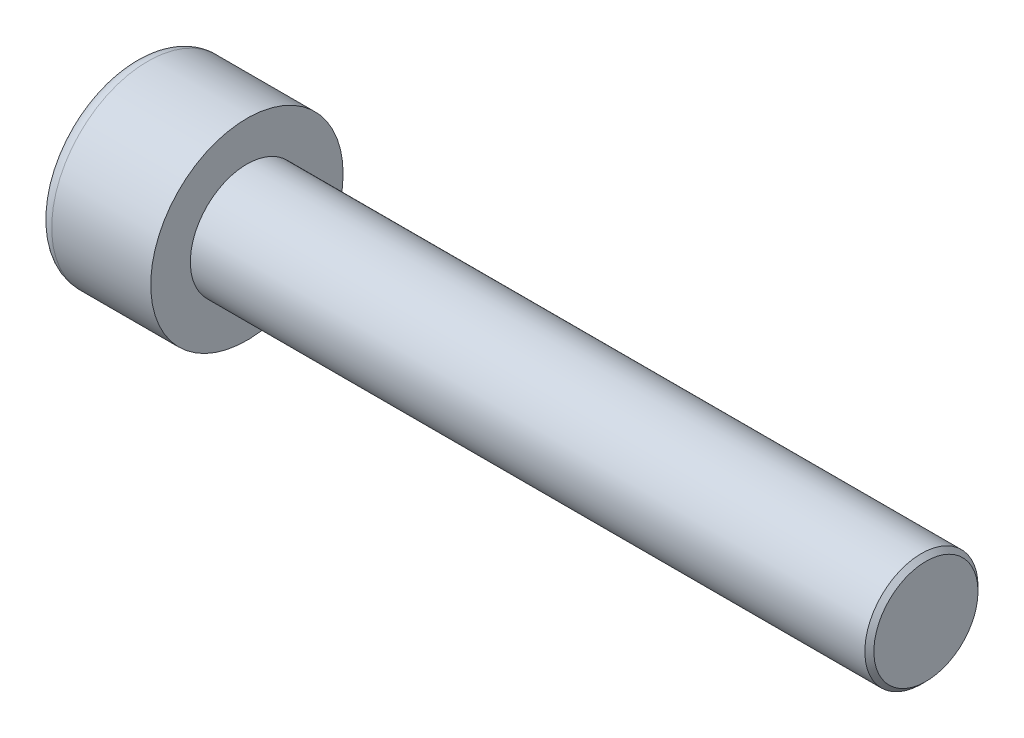
ISO-10303-21;
HEADER;
FILE_DESCRIPTION(('STEP AP214'),'2;1');
FILE_NAME('part.step','',(''),(''),'','','');
FILE_SCHEMA(('AUTOMOTIVE_DESIGN { 1 0 10303 214 1 1 1 1 }'));
ENDSEC;
DATA;
#1=APPLICATION_CONTEXT('core data for automotive mechanical design processes');
#2=APPLICATION_PROTOCOL_DEFINITION('international standard','automotive_design',2000,#1);
#3=PRODUCT_CONTEXT('',#1,'mechanical');
#4=PRODUCT('Part','Part','',(#3));
#5=PRODUCT_RELATED_PRODUCT_CATEGORY('part','',(#4));
#6=PRODUCT_DEFINITION_FORMATION('','',#4);
#7=PRODUCT_DEFINITION_CONTEXT('part definition',#1,'design');
#8=PRODUCT_DEFINITION('design','',#6,#7);
#9=PRODUCT_DEFINITION_SHAPE('','',#8);
#10=(LENGTH_UNIT() NAMED_UNIT(*) SI_UNIT(.MILLI.,.METRE.));
#11=(NAMED_UNIT(*) PLANE_ANGLE_UNIT() SI_UNIT($,.RADIAN.));
#12=(NAMED_UNIT(*) SI_UNIT($,.STERADIAN.) SOLID_ANGLE_UNIT());
#13=UNCERTAINTY_MEASURE_WITH_UNIT(LENGTH_MEASURE(1.E-05),#10,'distance_accuracy_value','');
#14=(GEOMETRIC_REPRESENTATION_CONTEXT(3) GLOBAL_UNCERTAINTY_ASSIGNED_CONTEXT((#13)) GLOBAL_UNIT_ASSIGNED_CONTEXT((#10,
#11,#12)) REPRESENTATION_CONTEXT('',''));
#15=CARTESIAN_POINT('',(0.,0.,0.));
#16=DIRECTION('',(0.,0.,1.));
#17=DIRECTION('',(1.,0.,0.));
#18=AXIS2_PLACEMENT_3D('',#15,#16,#17);
#19=CARTESIAN_POINT('',(2.5,0.,-2.3094010767585));
#20=DIRECTION('',(1.,0.,0.));
#21=DIRECTION('',(0.,0.,-1.));
#22=AXIS2_PLACEMENT_3D('',#19,#20,#21);
#23=PLANE('',#22);
#24=CARTESIAN_POINT('',(2.5,0.,0.));
#25=DIRECTION('',(1.,0.,0.));
#26=DIRECTION('',(0.,0.,-1.));
#27=AXIS2_PLACEMENT_3D('',#24,#25,#26);
#28=CIRCLE('',#27,2.);
#29=CARTESIAN_POINT('',(2.5,-1.,-1.73205080756888));
#30=VERTEX_POINT('',#29);
#31=CARTESIAN_POINT('',(2.5,-2.,0.));
#32=VERTEX_POINT('',#31);
#33=EDGE_CURVE('E196',#30,#32,#28,.F.);
#34=ORIENTED_EDGE('',*,*,#33,.F.);
#35=DIRECTION('',(0.,0.866025403784439,-0.5));
#36=VECTOR('',#35,1.);
#37=CARTESIAN_POINT('',(2.5,-2.,-1.15470053837925));
#38=LINE('',#37,#36);
#39=CARTESIAN_POINT('',(2.5,-2.,-1.15470053837925));
#40=VERTEX_POINT('',#39);
#41=EDGE_CURVE('E386',#40,#30,#38,.T.);
#42=ORIENTED_EDGE('',*,*,#41,.F.);
#43=DIRECTION('',(0.,0.,-1.));
#44=VECTOR('',#43,1.);
#45=CARTESIAN_POINT('',(2.5,-2.,1.15470053837925));
#46=LINE('',#45,#44);
#47=EDGE_CURVE('E348',#32,#40,#46,.T.);
#48=ORIENTED_EDGE('',*,*,#47,.F.);
#49=EDGE_LOOP('',(#34,#42,#48));
#50=FACE_BOUND('',#49,.T.);
#51=ADVANCED_FACE('F39',(#50),#23,.F.);
#52=CARTESIAN_POINT('',(2.5,-1.,1.73205080756888));
#53=VERTEX_POINT('',#52);
#54=EDGE_CURVE('E335',#32,#53,#28,.F.);
#55=ORIENTED_EDGE('',*,*,#54,.F.);
#56=CARTESIAN_POINT('',(2.5,-2.,1.15470053837925));
#57=VERTEX_POINT('',#56);
#58=EDGE_CURVE('E341',#57,#32,#46,.T.);
#59=ORIENTED_EDGE('',*,*,#58,.F.);
#60=DIRECTION('',(0.,-0.866025403784438,-0.5));
#61=VECTOR('',#60,1.);
#62=CARTESIAN_POINT('',(2.5,0.,2.3094010767585));
#63=LINE('',#62,#61);
#64=EDGE_CURVE('E338',#53,#57,#63,.T.);
#65=ORIENTED_EDGE('',*,*,#64,.F.);
#66=EDGE_LOOP('',(#55,#59,#65));
#67=FACE_BOUND('',#66,.T.);
#68=ADVANCED_FACE('F128',(#67),#23,.F.);
#69=CARTESIAN_POINT('',(2.5,1.,1.73205080756888));
#70=VERTEX_POINT('',#69);
#71=EDGE_CURVE('E328',#53,#70,#28,.F.);
#72=ORIENTED_EDGE('',*,*,#71,.F.);
#73=CARTESIAN_POINT('',(2.5,0.,2.3094010767585));
#74=VERTEX_POINT('',#73);
#75=EDGE_CURVE('E331',#74,#53,#63,.T.);
#76=ORIENTED_EDGE('',*,*,#75,.F.);
#77=DIRECTION('',(0.,-0.866025403784439,0.5));
#78=VECTOR('',#77,1.);
#79=CARTESIAN_POINT('',(2.5,2.,1.15470053837925));
#80=LINE('',#79,#78);
#81=EDGE_CURVE('E332',#70,#74,#80,.T.);
#82=ORIENTED_EDGE('',*,*,#81,.F.);
#83=EDGE_LOOP('',(#72,#76,#82));
#84=FACE_BOUND('',#83,.T.);
#85=ADVANCED_FACE('F133',(#84),#23,.F.);
#86=CARTESIAN_POINT('',(2.5,2.,0.));
#87=VERTEX_POINT('',#86);
#88=EDGE_CURVE('E194',#70,#87,#28,.F.);
#89=ORIENTED_EDGE('',*,*,#88,.F.);
#90=CARTESIAN_POINT('',(2.5,2.,1.15470053837925));
#91=VERTEX_POINT('',#90);
#92=EDGE_CURVE('E343',#91,#70,#80,.T.);
#93=ORIENTED_EDGE('',*,*,#92,.F.);
#94=DIRECTION('',(0.,0.,1.));
#95=VECTOR('',#94,1.);
#96=CARTESIAN_POINT('',(2.5,2.,-1.15470053837925));
#97=LINE('',#96,#95);
#98=EDGE_CURVE('E392',#87,#91,#97,.T.);
#99=ORIENTED_EDGE('',*,*,#98,.F.);
#100=EDGE_LOOP('',(#89,#93,#99));
#101=FACE_BOUND('',#100,.T.);
#102=ADVANCED_FACE('F285',(#101),#23,.F.);
#103=CARTESIAN_POINT('',(2.5,0.,0.));
#104=DIRECTION('',(1.,0.,0.));
#105=DIRECTION('',(0.,0.,-1.));
#106=AXIS2_PLACEMENT_3D('',#103,#104,#105);
#107=CIRCLE('',#106,2.);
#108=CARTESIAN_POINT('',(2.5,1.,-1.73205080756888));
#109=VERTEX_POINT('',#108);
#110=EDGE_CURVE('E54',#109,#87,#107,.T.);
#111=ORIENTED_EDGE('',*,*,#110,.T.);
#112=CARTESIAN_POINT('',(2.5,2.,-1.15470053837925));
#113=VERTEX_POINT('',#112);
#114=EDGE_CURVE('E393',#113,#87,#97,.T.);
#115=ORIENTED_EDGE('',*,*,#114,.F.);
#116=DIRECTION('',(0.,0.866025403784438,0.5));
#117=VECTOR('',#116,1.);
#118=CARTESIAN_POINT('',(2.5,0.,-2.3094010767585));
#119=LINE('',#118,#117);
#120=EDGE_CURVE('E387',#109,#113,#119,.T.);
#121=ORIENTED_EDGE('',*,*,#120,.F.);
#122=EDGE_LOOP('',(#111,#115,#121));
#123=FACE_BOUND('',#122,.T.);
#124=ADVANCED_FACE('F126',(#123),#23,.F.);
#125=CARTESIAN_POINT('',(0.,0.,0.));
#126=DIRECTION('',(1.,0.,0.));
#127=DIRECTION('',(0.,0.,-1.));
#128=AXIS2_PLACEMENT_3D('',#125,#126,#127);
#129=PLANE('',#128);
#130=CARTESIAN_POINT('',(0.,0.,0.));
#131=DIRECTION('',(1.,0.,0.));
#132=DIRECTION('',(0.,0.,-1.));
#133=AXIS2_PLACEMENT_3D('',#130,#131,#132);
#134=CIRCLE('',#133,3.625);
#135=CARTESIAN_POINT('',(0.,0.,-3.625));
#136=VERTEX_POINT('',#135);
#137=EDGE_CURVE('E203',#136,#136,#134,.F.);
#138=ORIENTED_EDGE('',*,*,#137,.T.);
#139=EDGE_LOOP('',(#138));
#140=FACE_BOUND('',#139,.T.);
#141=DIRECTION('',(0.,0.866025403784439,-0.5));
#142=VECTOR('',#141,1.);
#143=CARTESIAN_POINT('',(0.,-2.,-1.15470053837925));
#144=LINE('',#143,#142);
#145=CARTESIAN_POINT('',(0.,-2.,-1.15470053837925));
#146=VERTEX_POINT('',#145);
#147=CARTESIAN_POINT('',(0.,0.,-2.3094010767585));
#148=VERTEX_POINT('',#147);
#149=EDGE_CURVE('E62',#146,#148,#144,.T.);
#150=ORIENTED_EDGE('',*,*,#149,.T.);
#151=DIRECTION('',(0.,0.866025403784438,0.5));
#152=VECTOR('',#151,1.);
#153=CARTESIAN_POINT('',(0.,0.,-2.3094010767585));
#154=LINE('',#153,#152);
#155=CARTESIAN_POINT('',(0.,2.,-1.15470053837925));
#156=VERTEX_POINT('',#155);
#157=EDGE_CURVE('E355',#148,#156,#154,.T.);
#158=ORIENTED_EDGE('',*,*,#157,.T.);
#159=DIRECTION('',(0.,0.,1.));
#160=VECTOR('',#159,1.);
#161=CARTESIAN_POINT('',(0.,2.,-1.15470053837925));
#162=LINE('',#161,#160);
#163=CARTESIAN_POINT('',(0.,2.,1.15470053837925));
#164=VERTEX_POINT('',#163);
#165=EDGE_CURVE('E358',#156,#164,#162,.T.);
#166=ORIENTED_EDGE('',*,*,#165,.T.);
#167=DIRECTION('',(0.,-0.866025403784439,0.5));
#168=VECTOR('',#167,1.);
#169=CARTESIAN_POINT('',(0.,2.,1.15470053837925));
#170=LINE('',#169,#168);
#171=CARTESIAN_POINT('',(0.,0.,2.3094010767585));
#172=VERTEX_POINT('',#171);
#173=EDGE_CURVE('E361',#164,#172,#170,.T.);
#174=ORIENTED_EDGE('',*,*,#173,.T.);
#175=DIRECTION('',(0.,-0.866025403784438,-0.5));
#176=VECTOR('',#175,1.);
#177=CARTESIAN_POINT('',(0.,0.,2.3094010767585));
#178=LINE('',#177,#176);
#179=CARTESIAN_POINT('',(0.,-2.,1.15470053837925));
#180=VERTEX_POINT('',#179);
#181=EDGE_CURVE('E364',#172,#180,#178,.T.);
#182=ORIENTED_EDGE('',*,*,#181,.T.);
#183=DIRECTION('',(0.,0.,-1.));
#184=VECTOR('',#183,1.);
#185=CARTESIAN_POINT('',(0.,-2.,1.15470053837925));
#186=LINE('',#185,#184);
#187=EDGE_CURVE('E367',#180,#146,#186,.T.);
#188=ORIENTED_EDGE('',*,*,#187,.T.);
#189=EDGE_LOOP('',(#150,#158,#166,#174,#182,#188));
#190=FACE_BOUND('',#189,.T.);
#191=ADVANCED_FACE('F172',(#140,#190),#129,.F.);
#192=CARTESIAN_POINT('',(5.,0.,0.));
#193=DIRECTION('',(-1.,0.,0.));
#194=DIRECTION('',(0.,0.,1.));
#195=AXIS2_PLACEMENT_3D('',#192,#193,#194);
#196=CYLINDRICAL_SURFACE('',#195,4.25);
#197=CARTESIAN_POINT('',(0.625,0.,0.));
#198=DIRECTION('',(1.,0.,0.));
#199=DIRECTION('',(0.,0.,-1.));
#200=AXIS2_PLACEMENT_3D('',#197,#198,#199);
#201=CIRCLE('',#200,4.25);
#202=CARTESIAN_POINT('',(0.625,0.,-4.25));
#203=VERTEX_POINT('',#202);
#204=EDGE_CURVE('E183',#203,#203,#201,.T.);
#205=ORIENTED_EDGE('',*,*,#204,.T.);
#206=EDGE_LOOP('',(#205));
#207=FACE_BOUND('',#206,.T.);
#208=CARTESIAN_POINT('',(5.,0.,0.));
#209=DIRECTION('',(1.,0.,0.));
#210=DIRECTION('',(0.,0.,-1.));
#211=AXIS2_PLACEMENT_3D('',#208,#209,#210);
#212=CIRCLE('',#211,4.25);
#213=CARTESIAN_POINT('',(5.,0.,-4.25));
#214=VERTEX_POINT('',#213);
#215=EDGE_CURVE('E186',#214,#214,#212,.T.);
#216=ORIENTED_EDGE('',*,*,#215,.F.);
#217=EDGE_LOOP('',(#216));
#218=FACE_BOUND('',#217,.T.);
#219=ADVANCED_FACE('F170',(#207,#218),#196,.T.);
#220=CARTESIAN_POINT('',(5.,0.,0.));
#221=DIRECTION('',(1.,0.,0.));
#222=DIRECTION('',(0.,0.,-1.));
#223=AXIS2_PLACEMENT_3D('',#220,#221,#222);
#224=PLANE('',#223);
#225=CARTESIAN_POINT('',(5.,0.,0.));
#226=DIRECTION('',(1.,0.,0.));
#227=DIRECTION('',(0.,0.,-1.));
#228=AXIS2_PLACEMENT_3D('',#225,#226,#227);
#229=CIRCLE('',#228,2.5);
#230=CARTESIAN_POINT('',(5.,0.,-2.5));
#231=VERTEX_POINT('',#230);
#232=EDGE_CURVE('E190',#231,#231,#229,.T.);
#233=ORIENTED_EDGE('',*,*,#232,.F.);
#234=EDGE_LOOP('',(#233));
#235=FACE_BOUND('',#234,.T.);
#236=ORIENTED_EDGE('',*,*,#215,.T.);
#237=EDGE_LOOP('',(#236));
#238=FACE_BOUND('',#237,.T.);
#239=ADVANCED_FACE('F166',(#235,#238),#224,.T.);
#240=CARTESIAN_POINT('',(35.,0.,0.));
#241=DIRECTION('',(-1.,0.,0.));
#242=DIRECTION('',(0.,0.,1.));
#243=AXIS2_PLACEMENT_3D('',#240,#241,#242);
#244=CYLINDRICAL_SURFACE('',#243,2.5);
#245=CARTESIAN_POINT('',(34.8,0.,0.));
#246=DIRECTION('',(1.,0.,0.));
#247=DIRECTION('',(0.,0.,-1.));
#248=AXIS2_PLACEMENT_3D('',#245,#246,#247);
#249=CIRCLE('',#248,2.5);
#250=CARTESIAN_POINT('',(34.8,0.,-2.5));
#251=VERTEX_POINT('',#250);
#252=EDGE_CURVE('E11',#251,#251,#249,.F.);
#253=ORIENTED_EDGE('',*,*,#252,.T.);
#254=EDGE_LOOP('',(#253));
#255=FACE_BOUND('',#254,.T.);
#256=ORIENTED_EDGE('',*,*,#232,.T.);
#257=EDGE_LOOP('',(#256));
#258=FACE_BOUND('',#257,.T.);
#259=ADVANCED_FACE('F162',(#255,#258),#244,.T.);
#260=CARTESIAN_POINT('',(35.,0.,0.));
#261=DIRECTION('',(1.,0.,0.));
#262=DIRECTION('',(0.,0.,-1.));
#263=AXIS2_PLACEMENT_3D('',#260,#261,#262);
#264=PLANE('',#263);
#265=CARTESIAN_POINT('',(35.,0.,0.));
#266=DIRECTION('',(1.,0.,0.));
#267=DIRECTION('',(0.,0.,-1.));
#268=AXIS2_PLACEMENT_3D('',#265,#266,#267);
#269=CIRCLE('',#268,2.29999999999999);
#270=CARTESIAN_POINT('',(35.,0.,-2.29999999999999));
#271=VERTEX_POINT('',#270);
#272=EDGE_CURVE('E47',#271,#271,#269,.T.);
#273=ORIENTED_EDGE('',*,*,#272,.T.);
#274=EDGE_LOOP('',(#273));
#275=FACE_BOUND('',#274,.T.);
#276=ADVANCED_FACE('F159',(#275),#264,.T.);
#277=CARTESIAN_POINT('',(2.5,-2.,-1.15470053837925));
#278=DIRECTION('',(0.,0.5,0.866025403784439));
#279=DIRECTION('',(0.,-0.866025403784439,0.5));
#280=AXIS2_PLACEMENT_3D('',#277,#278,#279);
#281=PLANE('',#280);
#282=ORIENTED_EDGE('',*,*,#149,.F.);
#283=DIRECTION('',(-1.,0.,0.));
#284=VECTOR('',#283,1.);
#285=CARTESIAN_POINT('',(2.5,-2.,-1.15470053837925));
#286=LINE('',#285,#284);
#287=EDGE_CURVE('E353',#40,#146,#286,.T.);
#288=ORIENTED_EDGE('',*,*,#287,.F.);
#289=ORIENTED_EDGE('',*,*,#41,.T.);
#290=CARTESIAN_POINT('',(2.5,0.,-2.3094010767585));
#291=VERTEX_POINT('',#290);
#292=EDGE_CURVE('E370',#30,#291,#38,.T.);
#293=ORIENTED_EDGE('',*,*,#292,.T.);
#294=DIRECTION('',(-1.,0.,0.));
#295=VECTOR('',#294,1.);
#296=CARTESIAN_POINT('',(2.5,0.,-2.3094010767585));
#297=LINE('',#296,#295);
#298=EDGE_CURVE('E198',#291,#148,#297,.T.);
#299=ORIENTED_EDGE('',*,*,#298,.T.);
#300=EDGE_LOOP('',(#282,#288,#289,#293,#299));
#301=FACE_BOUND('',#300,.T.);
#302=ADVANCED_FACE('F155',(#301),#281,.T.);
#303=CARTESIAN_POINT('',(2.5,0.,-2.3094010767585));
#304=DIRECTION('',(0.,-0.5,0.866025403784438));
#305=DIRECTION('',(0.,-0.866025403784438,-0.5));
#306=AXIS2_PLACEMENT_3D('',#303,#304,#305);
#307=PLANE('',#306);
#308=ORIENTED_EDGE('',*,*,#157,.F.);
#309=ORIENTED_EDGE('',*,*,#298,.F.);
#310=EDGE_CURVE('E389',#291,#109,#119,.T.);
#311=ORIENTED_EDGE('',*,*,#310,.T.);
#312=ORIENTED_EDGE('',*,*,#120,.T.);
#313=DIRECTION('',(-1.,0.,0.));
#314=VECTOR('',#313,1.);
#315=CARTESIAN_POINT('',(2.5,2.,-1.15470053837925));
#316=LINE('',#315,#314);
#317=EDGE_CURVE('E377',#113,#156,#316,.T.);
#318=ORIENTED_EDGE('',*,*,#317,.T.);
#319=EDGE_LOOP('',(#308,#309,#311,#312,#318));
#320=FACE_BOUND('',#319,.T.);
#321=ADVANCED_FACE('F151',(#320),#307,.T.);
#322=CARTESIAN_POINT('',(2.5,2.,-1.15470053837925));
#323=DIRECTION('',(0.,-1.,0.));
#324=DIRECTION('',(0.,0.,-1.));
#325=AXIS2_PLACEMENT_3D('',#322,#323,#324);
#326=PLANE('',#325);
#327=ORIENTED_EDGE('',*,*,#165,.F.);
#328=ORIENTED_EDGE('',*,*,#317,.F.);
#329=ORIENTED_EDGE('',*,*,#114,.T.);
#330=ORIENTED_EDGE('',*,*,#98,.T.);
#331=DIRECTION('',(-1.,0.,0.));
#332=VECTOR('',#331,1.);
#333=CARTESIAN_POINT('',(2.5,2.,1.15470053837925));
#334=LINE('',#333,#332);
#335=EDGE_CURVE('E375',#91,#164,#334,.T.);
#336=ORIENTED_EDGE('',*,*,#335,.T.);
#337=EDGE_LOOP('',(#327,#328,#329,#330,#336));
#338=FACE_BOUND('',#337,.T.);
#339=ADVANCED_FACE('F147',(#338),#326,.T.);
#340=CARTESIAN_POINT('',(2.5,2.,1.15470053837925));
#341=DIRECTION('',(0.,-0.5,-0.866025403784439));
#342=DIRECTION('',(0.,0.866025403784439,-0.5));
#343=AXIS2_PLACEMENT_3D('',#340,#341,#342);
#344=PLANE('',#343);
#345=ORIENTED_EDGE('',*,*,#173,.F.);
#346=ORIENTED_EDGE('',*,*,#335,.F.);
#347=ORIENTED_EDGE('',*,*,#92,.T.);
#348=ORIENTED_EDGE('',*,*,#81,.T.);
#349=DIRECTION('',(-1.,0.,0.));
#350=VECTOR('',#349,1.);
#351=CARTESIAN_POINT('',(2.5,0.,2.3094010767585));
#352=LINE('',#351,#350);
#353=EDGE_CURVE('E347',#74,#172,#352,.T.);
#354=ORIENTED_EDGE('',*,*,#353,.T.);
#355=EDGE_LOOP('',(#345,#346,#347,#348,#354));
#356=FACE_BOUND('',#355,.T.);
#357=ADVANCED_FACE('F143',(#356),#344,.T.);
#358=CARTESIAN_POINT('',(2.5,0.,2.3094010767585));
#359=DIRECTION('',(0.,0.5,-0.866025403784438));
#360=DIRECTION('',(0.,0.866025403784438,0.5));
#361=AXIS2_PLACEMENT_3D('',#358,#359,#360);
#362=PLANE('',#361);
#363=ORIENTED_EDGE('',*,*,#181,.F.);
#364=ORIENTED_EDGE('',*,*,#353,.F.);
#365=ORIENTED_EDGE('',*,*,#75,.T.);
#366=ORIENTED_EDGE('',*,*,#64,.T.);
#367=DIRECTION('',(-1.,0.,0.));
#368=VECTOR('',#367,1.);
#369=CARTESIAN_POINT('',(2.5,-2.,1.15470053837925));
#370=LINE('',#369,#368);
#371=EDGE_CURVE('E372',#57,#180,#370,.T.);
#372=ORIENTED_EDGE('',*,*,#371,.T.);
#373=EDGE_LOOP('',(#363,#364,#365,#366,#372));
#374=FACE_BOUND('',#373,.T.);
#375=ADVANCED_FACE('F139',(#374),#362,.T.);
#376=CARTESIAN_POINT('',(2.5,-2.,1.15470053837925));
#377=DIRECTION('',(0.,1.,0.));
#378=DIRECTION('',(0.,0.,1.));
#379=AXIS2_PLACEMENT_3D('',#376,#377,#378);
#380=PLANE('',#379);
#381=ORIENTED_EDGE('',*,*,#187,.F.);
#382=ORIENTED_EDGE('',*,*,#371,.F.);
#383=ORIENTED_EDGE('',*,*,#58,.T.);
#384=ORIENTED_EDGE('',*,*,#47,.T.);
#385=ORIENTED_EDGE('',*,*,#287,.T.);
#386=EDGE_LOOP('',(#381,#382,#383,#384,#385));
#387=FACE_BOUND('',#386,.T.);
#388=ADVANCED_FACE('F123',(#387),#380,.T.);
#389=EDGE_CURVE('E189',#109,#30,#28,.F.);
#390=ORIENTED_EDGE('',*,*,#389,.F.);
#391=ORIENTED_EDGE('',*,*,#310,.F.);
#392=ORIENTED_EDGE('',*,*,#292,.F.);
#393=EDGE_LOOP('',(#390,#391,#392));
#394=FACE_BOUND('',#393,.T.);
#395=ADVANCED_FACE('F116',(#394),#23,.F.);
#396=CARTESIAN_POINT('',(2.5,0.,0.));
#397=DIRECTION('',(-1.,0.,0.));
#398=DIRECTION('',(0.,0.,1.));
#399=AXIS2_PLACEMENT_3D('',#396,#397,#398);
#400=CONICAL_SURFACE('',#399,2.,1.04719755119659);
#401=CARTESIAN_POINT('',(3.65470053837926,0.,0.));
#402=VERTEX_POINT('',#401);
#403=VERTEX_LOOP('',#402);
#404=FACE_BOUND('',#403,.T.);
#405=ORIENTED_EDGE('',*,*,#110,.F.);
#406=ORIENTED_EDGE('',*,*,#389,.T.);
#407=ORIENTED_EDGE('',*,*,#33,.T.);
#408=ORIENTED_EDGE('',*,*,#54,.T.);
#409=ORIENTED_EDGE('',*,*,#71,.T.);
#410=ORIENTED_EDGE('',*,*,#88,.T.);
#411=EDGE_LOOP('',(#405,#406,#407,#408,#409,#410));
#412=FACE_BOUND('',#411,.T.);
#413=ADVANCED_FACE('F113',(#404,#412),#400,.F.);
#414=CARTESIAN_POINT('',(0.625,0.,0.));
#415=DIRECTION('',(1.,0.,0.));
#416=DIRECTION('',(0.,0.,-1.));
#417=AXIS2_PLACEMENT_3D('',#414,#415,#416);
#418=TOROIDAL_SURFACE('',#417,3.625,0.625);
#419=ORIENTED_EDGE('',*,*,#137,.F.);
#420=EDGE_LOOP('',(#419));
#421=FACE_BOUND('',#420,.T.);
#422=ORIENTED_EDGE('',*,*,#204,.F.);
#423=EDGE_LOOP('',(#422));
#424=FACE_BOUND('',#423,.T.);
#425=ADVANCED_FACE('F115',(#421,#424),#418,.T.);
#426=CARTESIAN_POINT('',(35.,0.,0.));
#427=DIRECTION('',(-1.,0.,0.));
#428=DIRECTION('',(0.,0.,1.));
#429=AXIS2_PLACEMENT_3D('',#426,#427,#428);
#430=CONICAL_SURFACE('',#429,2.29999999999999,0.785398163397434);
#431=ORIENTED_EDGE('',*,*,#252,.F.);
#432=EDGE_LOOP('',(#431));
#433=FACE_BOUND('',#432,.T.);
#434=ORIENTED_EDGE('',*,*,#272,.F.);
#435=EDGE_LOOP('',(#434));
#436=FACE_BOUND('',#435,.T.);
#437=ADVANCED_FACE('F41',(#433,#436),#430,.T.);
#438=CLOSED_SHELL('',(#51,#68,#85,#102,#124,#191,#219,#239,#259,#276,#302,#321,#339,#357,#375,
#388,#395,#413,#425,#437));
#439=MANIFOLD_SOLID_BREP('B2',#438);
#440=ADVANCED_BREP_SHAPE_REPRESENTATION('',(#18,#439),#14);
#441=SHAPE_DEFINITION_REPRESENTATION(#9,#440);
ENDSEC;
END-ISO-10303-21;
